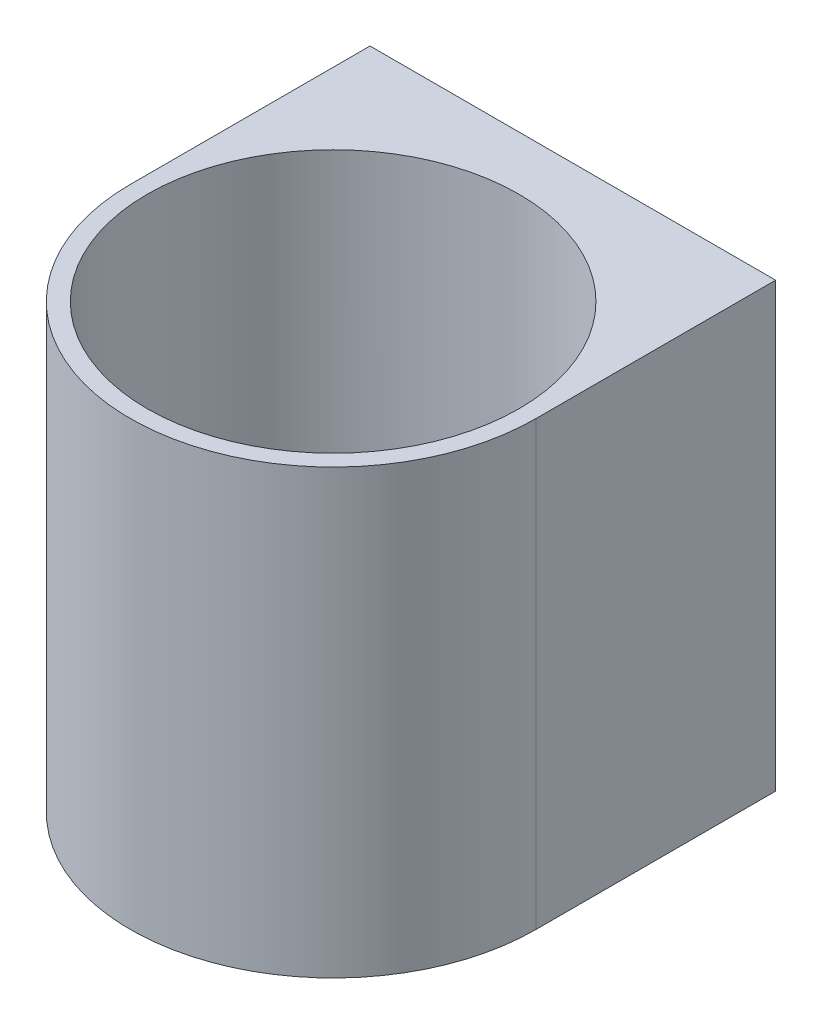
ISO-10303-21;
HEADER;
FILE_DESCRIPTION(('STEP AP214'),'2;1');
FILE_NAME('part.step','',(''),(''),'','','');
FILE_SCHEMA(('AUTOMOTIVE_DESIGN { 1 0 10303 214 1 1 1 1 }'));
ENDSEC;
DATA;
#1=APPLICATION_CONTEXT('core data for automotive mechanical design processes');
#2=APPLICATION_PROTOCOL_DEFINITION('international standard','automotive_design',2000,#1);
#3=PRODUCT_CONTEXT('',#1,'mechanical');
#4=PRODUCT('Part','Part','',(#3));
#5=PRODUCT_RELATED_PRODUCT_CATEGORY('part','',(#4));
#6=PRODUCT_DEFINITION_FORMATION('','',#4);
#7=PRODUCT_DEFINITION_CONTEXT('part definition',#1,'design');
#8=PRODUCT_DEFINITION('design','',#6,#7);
#9=PRODUCT_DEFINITION_SHAPE('','',#8);
#10=(LENGTH_UNIT() NAMED_UNIT(*) SI_UNIT(.MILLI.,.METRE.));
#11=(NAMED_UNIT(*) PLANE_ANGLE_UNIT() SI_UNIT($,.RADIAN.));
#12=(NAMED_UNIT(*) SI_UNIT($,.STERADIAN.) SOLID_ANGLE_UNIT());
#13=UNCERTAINTY_MEASURE_WITH_UNIT(LENGTH_MEASURE(1.E-05),#10,'distance_accuracy_value','');
#14=(GEOMETRIC_REPRESENTATION_CONTEXT(3) GLOBAL_UNCERTAINTY_ASSIGNED_CONTEXT((#13)) GLOBAL_UNIT_ASSIGNED_CONTEXT((#10,
#11,#12)) REPRESENTATION_CONTEXT('',''));
#15=CARTESIAN_POINT('',(0.,0.,0.));
#16=DIRECTION('',(0.,0.,1.));
#17=DIRECTION('',(1.,0.,0.));
#18=AXIS2_PLACEMENT_3D('',#15,#16,#17);
#19=CARTESIAN_POINT('',(-18.0065789473684,60.,16.0361842105263));
#20=DIRECTION('',(0.,-1.,0.));
#21=DIRECTION('',(0.,0.,-1.));
#22=AXIS2_PLACEMENT_3D('',#19,#20,#21);
#23=CYLINDRICAL_SURFACE('',#22,25.2);
#24=CARTESIAN_POINT('',(-18.0065789473684,60.,16.0361842105263));
#25=DIRECTION('',(0.,1.,0.));
#26=DIRECTION('',(0.,0.,1.));
#27=AXIS2_PLACEMENT_3D('',#24,#25,#26);
#28=CIRCLE('',#27,25.2);
#29=CARTESIAN_POINT('',(-18.0065789473684,60.,41.2361842105263));
#30=VERTEX_POINT('',#29);
#31=EDGE_CURVE('E172',#30,#30,#28,.T.);
#32=ORIENTED_EDGE('',*,*,#31,.T.);
#33=EDGE_LOOP('',(#32));
#34=FACE_BOUND('',#33,.T.);
#35=CARTESIAN_POINT('',(-18.0065789473684,9.3,16.0361842105263));
#36=DIRECTION('',(0.,-1.,0.));
#37=DIRECTION('',(0.,0.,-1.));
#38=AXIS2_PLACEMENT_3D('',#35,#36,#37);
#39=CIRCLE('',#38,25.2);
#40=CARTESIAN_POINT('',(-18.0065789473684,9.3,-9.16381578947369));
#41=VERTEX_POINT('',#40);
#42=EDGE_CURVE('E175',#41,#41,#39,.T.);
#43=ORIENTED_EDGE('',*,*,#42,.T.);
#44=EDGE_LOOP('',(#43));
#45=FACE_BOUND('',#44,.T.);
#46=ADVANCED_FACE('F86',(#34,#45),#23,.F.);
#47=CARTESIAN_POINT('',(9.49342105263159,60.,0.));
#48=DIRECTION('',(1.,0.,0.));
#49=DIRECTION('',(0.,0.,-1.));
#50=AXIS2_PLACEMENT_3D('',#47,#48,#49);
#51=PLANE('',#50);
#52=DIRECTION('',(0.,0.,1.));
#53=VECTOR('',#52,1.);
#54=CARTESIAN_POINT('',(9.49342105263159,0.,0.));
#55=LINE('',#54,#53);
#56=CARTESIAN_POINT('',(9.49342105263159,0.,-16.4638157894737));
#57=VERTEX_POINT('',#56);
#58=CARTESIAN_POINT('',(9.49342105263159,0.,16.0361842105263));
#59=VERTEX_POINT('',#58);
#60=EDGE_CURVE('E136',#57,#59,#55,.T.);
#61=ORIENTED_EDGE('',*,*,#60,.F.);
#62=DIRECTION('',(0.,-1.,0.));
#63=VECTOR('',#62,1.);
#64=CARTESIAN_POINT('',(9.49342105263159,60.,-16.4638157894737));
#65=LINE('',#64,#63);
#66=CARTESIAN_POINT('',(9.49342105263159,60.,-16.4638157894737));
#67=VERTEX_POINT('',#66);
#68=EDGE_CURVE('E97',#67,#57,#65,.T.);
#69=ORIENTED_EDGE('',*,*,#68,.F.);
#70=DIRECTION('',(0.,0.,1.));
#71=VECTOR('',#70,1.);
#72=CARTESIAN_POINT('',(9.49342105263159,60.,0.));
#73=LINE('',#72,#71);
#74=CARTESIAN_POINT('',(9.49342105263159,60.,16.0361842105263));
#75=VERTEX_POINT('',#74);
#76=EDGE_CURVE('E134',#67,#75,#73,.T.);
#77=ORIENTED_EDGE('',*,*,#76,.T.);
#78=DIRECTION('',(0.,-1.,0.));
#79=VECTOR('',#78,1.);
#80=CARTESIAN_POINT('',(9.49342105263159,60.,16.0361842105263));
#81=LINE('',#80,#79);
#82=EDGE_CURVE('E12',#75,#59,#81,.T.);
#83=ORIENTED_EDGE('',*,*,#82,.T.);
#84=EDGE_LOOP('',(#61,#69,#77,#83));
#85=FACE_BOUND('',#84,.T.);
#86=ADVANCED_FACE('F133',(#85),#51,.T.);
#87=CARTESIAN_POINT('',(0.,60.,-16.4638157894737));
#88=DIRECTION('',(0.,0.,-1.));
#89=DIRECTION('',(-1.,0.,0.));
#90=AXIS2_PLACEMENT_3D('',#87,#88,#89);
#91=PLANE('',#90);
#92=DIRECTION('',(1.,0.,0.));
#93=VECTOR('',#92,1.);
#94=CARTESIAN_POINT('',(0.,0.,-16.4638157894737));
#95=LINE('',#94,#93);
#96=CARTESIAN_POINT('',(-45.5065789473684,0.,-16.4638157894737));
#97=VERTEX_POINT('',#96);
#98=EDGE_CURVE('E163',#97,#57,#95,.T.);
#99=ORIENTED_EDGE('',*,*,#98,.F.);
#100=DIRECTION('',(0.,-1.,0.));
#101=VECTOR('',#100,1.);
#102=CARTESIAN_POINT('',(-45.5065789473684,60.,-16.4638157894737));
#103=LINE('',#102,#101);
#104=CARTESIAN_POINT('',(-45.5065789473684,60.,-16.4638157894737));
#105=VERTEX_POINT('',#104);
#106=EDGE_CURVE('E119',#105,#97,#103,.T.);
#107=ORIENTED_EDGE('',*,*,#106,.F.);
#108=DIRECTION('',(1.,0.,0.));
#109=VECTOR('',#108,1.);
#110=CARTESIAN_POINT('',(0.,60.,-16.4638157894737));
#111=LINE('',#110,#109);
#112=EDGE_CURVE('E148',#105,#67,#111,.T.);
#113=ORIENTED_EDGE('',*,*,#112,.T.);
#114=ORIENTED_EDGE('',*,*,#68,.T.);
#115=EDGE_LOOP('',(#99,#107,#113,#114));
#116=FACE_BOUND('',#115,.T.);
#117=ADVANCED_FACE('F153',(#116),#91,.T.);
#118=CARTESIAN_POINT('',(-45.5065789473684,60.,0.));
#119=DIRECTION('',(1.,0.,0.));
#120=DIRECTION('',(0.,0.,-1.));
#121=AXIS2_PLACEMENT_3D('',#118,#119,#120);
#122=PLANE('',#121);
#123=DIRECTION('',(0.,0.,1.));
#124=VECTOR('',#123,1.);
#125=CARTESIAN_POINT('',(-45.5065789473684,0.,0.));
#126=LINE('',#125,#124);
#127=CARTESIAN_POINT('',(-45.5065789473684,0.,16.0361842105263));
#128=VERTEX_POINT('',#127);
#129=EDGE_CURVE('E151',#97,#128,#126,.T.);
#130=ORIENTED_EDGE('',*,*,#129,.T.);
#131=DIRECTION('',(0.,-1.,0.));
#132=VECTOR('',#131,1.);
#133=CARTESIAN_POINT('',(-45.5065789473684,60.,16.0361842105263));
#134=LINE('',#133,#132);
#135=CARTESIAN_POINT('',(-45.5065789473684,60.,16.0361842105263));
#136=VERTEX_POINT('',#135);
#137=EDGE_CURVE('E106',#136,#128,#134,.T.);
#138=ORIENTED_EDGE('',*,*,#137,.F.);
#139=DIRECTION('',(0.,0.,1.));
#140=VECTOR('',#139,1.);
#141=CARTESIAN_POINT('',(-45.5065789473684,60.,0.));
#142=LINE('',#141,#140);
#143=EDGE_CURVE('E155',#105,#136,#142,.T.);
#144=ORIENTED_EDGE('',*,*,#143,.F.);
#145=ORIENTED_EDGE('',*,*,#106,.T.);
#146=EDGE_LOOP('',(#130,#138,#144,#145));
#147=FACE_BOUND('',#146,.T.);
#148=ADVANCED_FACE('F180',(#147),#122,.F.);
#149=CARTESIAN_POINT('',(0.,0.,0.));
#150=DIRECTION('',(0.,1.,0.));
#151=DIRECTION('',(0.,0.,1.));
#152=AXIS2_PLACEMENT_3D('',#149,#150,#151);
#153=PLANE('',#152);
#154=CARTESIAN_POINT('',(-18.0065789473684,0.,-3.96381578947368));
#155=DIRECTION('',(0.,1.,0.));
#156=DIRECTION('',(0.,0.,1.));
#157=AXIS2_PLACEMENT_3D('',#154,#155,#156);
#158=CIRCLE('',#157,3.5);
#159=CARTESIAN_POINT('',(-18.0065789473684,0.,-0.46381578947368));
#160=VERTEX_POINT('',#159);
#161=EDGE_CURVE('E204',#160,#160,#158,.T.);
#162=ORIENTED_EDGE('',*,*,#161,.T.);
#163=EDGE_LOOP('',(#162));
#164=FACE_BOUND('',#163,.T.);
#165=CARTESIAN_POINT('',(-18.0065789473684,0.,26.0361842105263));
#166=DIRECTION('',(0.,1.,0.));
#167=DIRECTION('',(0.,0.,1.));
#168=AXIS2_PLACEMENT_3D('',#165,#166,#167);
#169=CIRCLE('',#168,3.5);
#170=CARTESIAN_POINT('',(-18.0065789473684,0.,29.5361842105263));
#171=VERTEX_POINT('',#170);
#172=EDGE_CURVE('E284',#171,#171,#169,.T.);
#173=ORIENTED_EDGE('',*,*,#172,.T.);
#174=EDGE_LOOP('',(#173));
#175=FACE_BOUND('',#174,.T.);
#176=CARTESIAN_POINT('',(-8.00657894736841,0.,26.0361842105263));
#177=DIRECTION('',(0.,1.,0.));
#178=DIRECTION('',(0.,0.,1.));
#179=AXIS2_PLACEMENT_3D('',#176,#177,#178);
#180=CIRCLE('',#179,3.5);
#181=CARTESIAN_POINT('',(-8.00657894736841,0.,29.5361842105263));
#182=VERTEX_POINT('',#181);
#183=EDGE_CURVE('E275',#182,#182,#180,.T.);
#184=ORIENTED_EDGE('',*,*,#183,.T.);
#185=EDGE_LOOP('',(#184));
#186=FACE_BOUND('',#185,.T.);
#187=CARTESIAN_POINT('',(-18.0065789473684,0.,36.0361842105263));
#188=DIRECTION('',(0.,1.,0.));
#189=DIRECTION('',(0.,0.,1.));
#190=AXIS2_PLACEMENT_3D('',#187,#188,#189);
#191=CIRCLE('',#190,3.5);
#192=CARTESIAN_POINT('',(-18.0065789473684,0.,39.5361842105263));
#193=VERTEX_POINT('',#192);
#194=EDGE_CURVE('E299',#193,#193,#191,.T.);
#195=ORIENTED_EDGE('',*,*,#194,.T.);
#196=EDGE_LOOP('',(#195));
#197=FACE_BOUND('',#196,.T.);
#198=CARTESIAN_POINT('',(-28.0065789473684,0.,16.0361842105263));
#199=DIRECTION('',(0.,1.,0.));
#200=DIRECTION('',(0.,0.,1.));
#201=AXIS2_PLACEMENT_3D('',#198,#199,#200);
#202=CIRCLE('',#201,3.5);
#203=CARTESIAN_POINT('',(-28.0065789473684,0.,19.5361842105263));
#204=VERTEX_POINT('',#203);
#205=EDGE_CURVE('E291',#204,#204,#202,.T.);
#206=ORIENTED_EDGE('',*,*,#205,.T.);
#207=EDGE_LOOP('',(#206));
#208=FACE_BOUND('',#207,.T.);
#209=CARTESIAN_POINT('',(-18.0065789473684,0.,6.03618421052632));
#210=DIRECTION('',(0.,1.,0.));
#211=DIRECTION('',(0.,0.,1.));
#212=AXIS2_PLACEMENT_3D('',#209,#210,#211);
#213=CIRCLE('',#212,3.5);
#214=CARTESIAN_POINT('',(-18.0065789473684,0.,9.53618421052632));
#215=VERTEX_POINT('',#214);
#216=EDGE_CURVE('E235',#215,#215,#213,.T.);
#217=ORIENTED_EDGE('',*,*,#216,.T.);
#218=EDGE_LOOP('',(#217));
#219=FACE_BOUND('',#218,.T.);
#220=CARTESIAN_POINT('',(-28.0065789473684,0.,6.03618421052632));
#221=DIRECTION('',(0.,1.,0.));
#222=DIRECTION('',(0.,0.,1.));
#223=AXIS2_PLACEMENT_3D('',#220,#221,#222);
#224=CIRCLE('',#223,3.5);
#225=CARTESIAN_POINT('',(-28.0065789473684,0.,9.53618421052632));
#226=VERTEX_POINT('',#225);
#227=EDGE_CURVE('E227',#226,#226,#224,.T.);
#228=ORIENTED_EDGE('',*,*,#227,.T.);
#229=EDGE_LOOP('',(#228));
#230=FACE_BOUND('',#229,.T.);
#231=CARTESIAN_POINT('',(-8.00657894736841,0.,6.03618421052632));
#232=DIRECTION('',(0.,1.,0.));
#233=DIRECTION('',(0.,0.,1.));
#234=AXIS2_PLACEMENT_3D('',#231,#232,#233);
#235=CIRCLE('',#234,3.5);
#236=CARTESIAN_POINT('',(-8.00657894736841,0.,9.53618421052632));
#237=VERTEX_POINT('',#236);
#238=EDGE_CURVE('E219',#237,#237,#235,.T.);
#239=ORIENTED_EDGE('',*,*,#238,.T.);
#240=EDGE_LOOP('',(#239));
#241=FACE_BOUND('',#240,.T.);
#242=CARTESIAN_POINT('',(-8.00657894736841,0.,16.0361842105263));
#243=DIRECTION('',(0.,1.,0.));
#244=DIRECTION('',(0.,0.,1.));
#245=AXIS2_PLACEMENT_3D('',#242,#243,#244);
#246=CIRCLE('',#245,3.5);
#247=CARTESIAN_POINT('',(-8.00657894736841,0.,19.5361842105263));
#248=VERTEX_POINT('',#247);
#249=EDGE_CURVE('E210',#248,#248,#246,.T.);
#250=ORIENTED_EDGE('',*,*,#249,.T.);
#251=EDGE_LOOP('',(#250));
#252=FACE_BOUND('',#251,.T.);
#253=CARTESIAN_POINT('',(1.99342105263159,0.,16.0361842105263));
#254=DIRECTION('',(0.,1.,0.));
#255=DIRECTION('',(0.,0.,1.));
#256=AXIS2_PLACEMENT_3D('',#253,#254,#255);
#257=CIRCLE('',#256,3.5);
#258=CARTESIAN_POINT('',(1.99342105263159,0.,19.5361842105263));
#259=VERTEX_POINT('',#258);
#260=EDGE_CURVE('E268',#259,#259,#257,.T.);
#261=ORIENTED_EDGE('',*,*,#260,.T.);
#262=EDGE_LOOP('',(#261));
#263=FACE_BOUND('',#262,.T.);
#264=CARTESIAN_POINT('',(-18.0065789473684,0.,16.0361842105263));
#265=DIRECTION('',(0.,1.,0.));
#266=DIRECTION('',(0.,0.,1.));
#267=AXIS2_PLACEMENT_3D('',#264,#265,#266);
#268=CIRCLE('',#267,3.5);
#269=CARTESIAN_POINT('',(-18.0065789473684,0.,19.5361842105263));
#270=VERTEX_POINT('',#269);
#271=EDGE_CURVE('E260',#270,#270,#268,.T.);
#272=ORIENTED_EDGE('',*,*,#271,.T.);
#273=EDGE_LOOP('',(#272));
#274=FACE_BOUND('',#273,.T.);
#275=CARTESIAN_POINT('',(-38.0065789473684,0.,16.0361842105263));
#276=DIRECTION('',(0.,1.,0.));
#277=DIRECTION('',(0.,0.,1.));
#278=AXIS2_PLACEMENT_3D('',#275,#276,#277);
#279=CIRCLE('',#278,3.5);
#280=CARTESIAN_POINT('',(-38.0065789473684,0.,19.5361842105263));
#281=VERTEX_POINT('',#280);
#282=EDGE_CURVE('E252',#281,#281,#279,.T.);
#283=ORIENTED_EDGE('',*,*,#282,.T.);
#284=EDGE_LOOP('',(#283));
#285=FACE_BOUND('',#284,.T.);
#286=CARTESIAN_POINT('',(-28.0065789473684,0.,26.0361842105263));
#287=DIRECTION('',(0.,1.,0.));
#288=DIRECTION('',(0.,0.,1.));
#289=AXIS2_PLACEMENT_3D('',#286,#287,#288);
#290=CIRCLE('',#289,3.5);
#291=CARTESIAN_POINT('',(-28.0065789473684,0.,29.5361842105263));
#292=VERTEX_POINT('',#291);
#293=EDGE_CURVE('E243',#292,#292,#290,.T.);
#294=ORIENTED_EDGE('',*,*,#293,.T.);
#295=EDGE_LOOP('',(#294));
#296=FACE_BOUND('',#295,.T.);
#297=ORIENTED_EDGE('',*,*,#60,.T.);
#298=CARTESIAN_POINT('',(-18.0065789473684,0.,16.0361842105263));
#299=DIRECTION('',(0.,1.,0.));
#300=DIRECTION('',(0.,0.,1.));
#301=AXIS2_PLACEMENT_3D('',#298,#299,#300);
#302=CIRCLE('',#301,27.5);
#303=EDGE_CURVE('E90',#128,#59,#302,.T.);
#304=ORIENTED_EDGE('',*,*,#303,.F.);
#305=ORIENTED_EDGE('',*,*,#129,.F.);
#306=ORIENTED_EDGE('',*,*,#98,.T.);
#307=EDGE_LOOP('',(#297,#304,#305,#306));
#308=FACE_BOUND('',#307,.T.);
#309=ADVANCED_FACE('F179',(#164,#175,#186,#197,#208,#219,#230,#241,#252,#263,#274,#285,#296,
#308),#153,.F.);
#310=CARTESIAN_POINT('',(0.,60.,0.));
#311=DIRECTION('',(0.,1.,0.));
#312=DIRECTION('',(0.,0.,1.));
#313=AXIS2_PLACEMENT_3D('',#310,#311,#312);
#314=PLANE('',#313);
#315=ORIENTED_EDGE('',*,*,#143,.T.);
#316=CARTESIAN_POINT('',(-18.0065789473684,60.,16.0361842105263));
#317=DIRECTION('',(0.,1.,0.));
#318=DIRECTION('',(0.,0.,1.));
#319=AXIS2_PLACEMENT_3D('',#316,#317,#318);
#320=CIRCLE('',#319,27.5);
#321=EDGE_CURVE('E149',#136,#75,#320,.T.);
#322=ORIENTED_EDGE('',*,*,#321,.T.);
#323=ORIENTED_EDGE('',*,*,#76,.F.);
#324=ORIENTED_EDGE('',*,*,#112,.F.);
#325=EDGE_LOOP('',(#315,#322,#323,#324));
#326=FACE_BOUND('',#325,.T.);
#327=ORIENTED_EDGE('',*,*,#31,.F.);
#328=EDGE_LOOP('',(#327));
#329=FACE_BOUND('',#328,.T.);
#330=ADVANCED_FACE('F146',(#326,#329),#314,.T.);
#331=CARTESIAN_POINT('',(-18.0065789473684,60.,16.0361842105263));
#332=DIRECTION('',(0.,-1.,0.));
#333=DIRECTION('',(0.,0.,-1.));
#334=AXIS2_PLACEMENT_3D('',#331,#332,#333);
#335=CYLINDRICAL_SURFACE('',#334,27.5);
#336=ORIENTED_EDGE('',*,*,#303,.T.);
#337=ORIENTED_EDGE('',*,*,#82,.F.);
#338=ORIENTED_EDGE('',*,*,#321,.F.);
#339=ORIENTED_EDGE('',*,*,#137,.T.);
#340=EDGE_LOOP('',(#336,#337,#338,#339));
#341=FACE_BOUND('',#340,.T.);
#342=ADVANCED_FACE('F88',(#341),#335,.T.);
#343=CARTESIAN_POINT('',(-18.0065789473684,9.3,16.0361842105263));
#344=DIRECTION('',(0.,-1.,0.));
#345=DIRECTION('',(0.,0.,-1.));
#346=AXIS2_PLACEMENT_3D('',#343,#344,#345);
#347=PLANE('',#346);
#348=CARTESIAN_POINT('',(-18.0065789473684,9.3,-3.96381578947368));
#349=DIRECTION('',(0.,1.,0.));
#350=DIRECTION('',(0.,0.,1.));
#351=AXIS2_PLACEMENT_3D('',#348,#349,#350);
#352=CIRCLE('',#351,3.5);
#353=CARTESIAN_POINT('',(-18.0065789473684,9.3,-0.46381578947368));
#354=VERTEX_POINT('',#353);
#355=EDGE_CURVE('E207',#354,#354,#352,.T.);
#356=ORIENTED_EDGE('',*,*,#355,.F.);
#357=EDGE_LOOP('',(#356));
#358=FACE_BOUND('',#357,.T.);
#359=CARTESIAN_POINT('',(-18.0065789473684,9.3,26.0361842105263));
#360=DIRECTION('',(0.,1.,0.));
#361=DIRECTION('',(0.,0.,1.));
#362=AXIS2_PLACEMENT_3D('',#359,#360,#361);
#363=CIRCLE('',#362,3.5);
#364=CARTESIAN_POINT('',(-18.0065789473684,9.3,29.5361842105263));
#365=VERTEX_POINT('',#364);
#366=EDGE_CURVE('E248',#365,#365,#363,.T.);
#367=ORIENTED_EDGE('',*,*,#366,.F.);
#368=EDGE_LOOP('',(#367));
#369=FACE_BOUND('',#368,.T.);
#370=CARTESIAN_POINT('',(-8.00657894736841,9.3,26.0361842105263));
#371=DIRECTION('',(0.,1.,0.));
#372=DIRECTION('',(0.,0.,1.));
#373=AXIS2_PLACEMENT_3D('',#370,#371,#372);
#374=CIRCLE('',#373,3.5);
#375=CARTESIAN_POINT('',(-8.00657894736841,9.3,29.5361842105263));
#376=VERTEX_POINT('',#375);
#377=EDGE_CURVE('E279',#376,#376,#374,.T.);
#378=ORIENTED_EDGE('',*,*,#377,.F.);
#379=EDGE_LOOP('',(#378));
#380=FACE_BOUND('',#379,.T.);
#381=CARTESIAN_POINT('',(-18.0065789473684,9.3,36.0361842105263));
#382=DIRECTION('',(0.,1.,0.));
#383=DIRECTION('',(0.,0.,1.));
#384=AXIS2_PLACEMENT_3D('',#381,#382,#383);
#385=CIRCLE('',#384,3.5);
#386=CARTESIAN_POINT('',(-18.0065789473684,9.3,39.5361842105263));
#387=VERTEX_POINT('',#386);
#388=EDGE_CURVE('E280',#387,#387,#385,.T.);
#389=ORIENTED_EDGE('',*,*,#388,.F.);
#390=EDGE_LOOP('',(#389));
#391=FACE_BOUND('',#390,.T.);
#392=CARTESIAN_POINT('',(-28.0065789473684,9.3,16.0361842105263));
#393=DIRECTION('',(0.,1.,0.));
#394=DIRECTION('',(0.,0.,1.));
#395=AXIS2_PLACEMENT_3D('',#392,#393,#394);
#396=CIRCLE('',#395,3.5);
#397=CARTESIAN_POINT('',(-28.0065789473684,9.3,19.5361842105263));
#398=VERTEX_POINT('',#397);
#399=EDGE_CURVE('E295',#398,#398,#396,.T.);
#400=ORIENTED_EDGE('',*,*,#399,.F.);
#401=EDGE_LOOP('',(#400));
#402=FACE_BOUND('',#401,.T.);
#403=CARTESIAN_POINT('',(-18.0065789473684,9.3,6.03618421052632));
#404=DIRECTION('',(0.,1.,0.));
#405=DIRECTION('',(0.,0.,1.));
#406=AXIS2_PLACEMENT_3D('',#403,#404,#405);
#407=CIRCLE('',#406,3.5);
#408=CARTESIAN_POINT('',(-18.0065789473684,9.3,9.53618421052632));
#409=VERTEX_POINT('',#408);
#410=EDGE_CURVE('E239',#409,#409,#407,.T.);
#411=ORIENTED_EDGE('',*,*,#410,.F.);
#412=EDGE_LOOP('',(#411));
#413=FACE_BOUND('',#412,.T.);
#414=CARTESIAN_POINT('',(-28.0065789473684,9.3,6.03618421052632));
#415=DIRECTION('',(0.,1.,0.));
#416=DIRECTION('',(0.,0.,1.));
#417=AXIS2_PLACEMENT_3D('',#414,#415,#416);
#418=CIRCLE('',#417,3.5);
#419=CARTESIAN_POINT('',(-28.0065789473684,9.3,9.53618421052632));
#420=VERTEX_POINT('',#419);
#421=EDGE_CURVE('E231',#420,#420,#418,.T.);
#422=ORIENTED_EDGE('',*,*,#421,.F.);
#423=EDGE_LOOP('',(#422));
#424=FACE_BOUND('',#423,.T.);
#425=CARTESIAN_POINT('',(-8.00657894736841,9.3,6.03618421052632));
#426=DIRECTION('',(0.,1.,0.));
#427=DIRECTION('',(0.,0.,1.));
#428=AXIS2_PLACEMENT_3D('',#425,#426,#427);
#429=CIRCLE('',#428,3.5);
#430=CARTESIAN_POINT('',(-8.00657894736841,9.3,9.53618421052632));
#431=VERTEX_POINT('',#430);
#432=EDGE_CURVE('E223',#431,#431,#429,.T.);
#433=ORIENTED_EDGE('',*,*,#432,.F.);
#434=EDGE_LOOP('',(#433));
#435=FACE_BOUND('',#434,.T.);
#436=CARTESIAN_POINT('',(-8.00657894736841,9.3,16.0361842105263));
#437=DIRECTION('',(0.,1.,0.));
#438=DIRECTION('',(0.,0.,1.));
#439=AXIS2_PLACEMENT_3D('',#436,#437,#438);
#440=CIRCLE('',#439,3.5);
#441=CARTESIAN_POINT('',(-8.00657894736841,9.3,19.5361842105263));
#442=VERTEX_POINT('',#441);
#443=EDGE_CURVE('E214',#442,#442,#440,.T.);
#444=ORIENTED_EDGE('',*,*,#443,.F.);
#445=EDGE_LOOP('',(#444));
#446=FACE_BOUND('',#445,.T.);
#447=CARTESIAN_POINT('',(1.99342105263159,9.3,16.0361842105263));
#448=DIRECTION('',(0.,1.,0.));
#449=DIRECTION('',(0.,0.,1.));
#450=AXIS2_PLACEMENT_3D('',#447,#448,#449);
#451=CIRCLE('',#450,3.5);
#452=CARTESIAN_POINT('',(1.99342105263159,9.3,19.5361842105263));
#453=VERTEX_POINT('',#452);
#454=EDGE_CURVE('E215',#453,#453,#451,.T.);
#455=ORIENTED_EDGE('',*,*,#454,.F.);
#456=EDGE_LOOP('',(#455));
#457=FACE_BOUND('',#456,.T.);
#458=CARTESIAN_POINT('',(-18.0065789473684,9.3,16.0361842105263));
#459=DIRECTION('',(0.,1.,0.));
#460=DIRECTION('',(0.,0.,1.));
#461=AXIS2_PLACEMENT_3D('',#458,#459,#460);
#462=CIRCLE('',#461,3.5);
#463=CARTESIAN_POINT('',(-18.0065789473684,9.3,19.5361842105263));
#464=VERTEX_POINT('',#463);
#465=EDGE_CURVE('E264',#464,#464,#462,.T.);
#466=ORIENTED_EDGE('',*,*,#465,.F.);
#467=EDGE_LOOP('',(#466));
#468=FACE_BOUND('',#467,.T.);
#469=CARTESIAN_POINT('',(-38.0065789473684,9.3,16.0361842105263));
#470=DIRECTION('',(0.,1.,0.));
#471=DIRECTION('',(0.,0.,1.));
#472=AXIS2_PLACEMENT_3D('',#469,#470,#471);
#473=CIRCLE('',#472,3.5);
#474=CARTESIAN_POINT('',(-38.0065789473684,9.3,19.5361842105263));
#475=VERTEX_POINT('',#474);
#476=EDGE_CURVE('E256',#475,#475,#473,.T.);
#477=ORIENTED_EDGE('',*,*,#476,.F.);
#478=EDGE_LOOP('',(#477));
#479=FACE_BOUND('',#478,.T.);
#480=CARTESIAN_POINT('',(-28.0065789473684,9.3,26.0361842105263));
#481=DIRECTION('',(0.,1.,0.));
#482=DIRECTION('',(0.,0.,1.));
#483=AXIS2_PLACEMENT_3D('',#480,#481,#482);
#484=CIRCLE('',#483,3.5);
#485=CARTESIAN_POINT('',(-28.0065789473684,9.3,29.5361842105263));
#486=VERTEX_POINT('',#485);
#487=EDGE_CURVE('E247',#486,#486,#484,.T.);
#488=ORIENTED_EDGE('',*,*,#487,.F.);
#489=EDGE_LOOP('',(#488));
#490=FACE_BOUND('',#489,.T.);
#491=ORIENTED_EDGE('',*,*,#42,.F.);
#492=EDGE_LOOP('',(#491));
#493=FACE_BOUND('',#492,.T.);
#494=ADVANCED_FACE('F312',(#358,#369,#380,#391,#402,#413,#424,#435,#446,#457,#468,#479,#490,
#493),#347,.F.);
#495=CARTESIAN_POINT('',(-28.0065789473684,0.,26.0361842105263));
#496=DIRECTION('',(0.,1.,0.));
#497=DIRECTION('',(0.,0.,1.));
#498=AXIS2_PLACEMENT_3D('',#495,#496,#497);
#499=CYLINDRICAL_SURFACE('',#498,3.5);
#500=ORIENTED_EDGE('',*,*,#293,.F.);
#501=EDGE_LOOP('',(#500));
#502=FACE_BOUND('',#501,.T.);
#503=ORIENTED_EDGE('',*,*,#487,.T.);
#504=EDGE_LOOP('',(#503));
#505=FACE_BOUND('',#504,.T.);
#506=ADVANCED_FACE('F315',(#502,#505),#499,.F.);
#507=CARTESIAN_POINT('',(-38.0065789473684,0.,16.0361842105263));
#508=DIRECTION('',(0.,1.,0.));
#509=DIRECTION('',(0.,0.,1.));
#510=AXIS2_PLACEMENT_3D('',#507,#508,#509);
#511=CYLINDRICAL_SURFACE('',#510,3.5);
#512=ORIENTED_EDGE('',*,*,#282,.F.);
#513=EDGE_LOOP('',(#512));
#514=FACE_BOUND('',#513,.T.);
#515=ORIENTED_EDGE('',*,*,#476,.T.);
#516=EDGE_LOOP('',(#515));
#517=FACE_BOUND('',#516,.T.);
#518=ADVANCED_FACE('F342',(#514,#517),#511,.F.);
#519=CARTESIAN_POINT('',(-18.0065789473684,0.,16.0361842105263));
#520=DIRECTION('',(0.,1.,0.));
#521=DIRECTION('',(0.,0.,1.));
#522=AXIS2_PLACEMENT_3D('',#519,#520,#521);
#523=CYLINDRICAL_SURFACE('',#522,3.5);
#524=ORIENTED_EDGE('',*,*,#271,.F.);
#525=EDGE_LOOP('',(#524));
#526=FACE_BOUND('',#525,.T.);
#527=ORIENTED_EDGE('',*,*,#465,.T.);
#528=EDGE_LOOP('',(#527));
#529=FACE_BOUND('',#528,.T.);
#530=ADVANCED_FACE('F348',(#526,#529),#523,.F.);
#531=CARTESIAN_POINT('',(1.99342105263159,0.,16.0361842105263));
#532=DIRECTION('',(0.,1.,0.));
#533=DIRECTION('',(0.,0.,1.));
#534=AXIS2_PLACEMENT_3D('',#531,#532,#533);
#535=CYLINDRICAL_SURFACE('',#534,3.5);
#536=ORIENTED_EDGE('',*,*,#260,.F.);
#537=EDGE_LOOP('',(#536));
#538=FACE_BOUND('',#537,.T.);
#539=ORIENTED_EDGE('',*,*,#454,.T.);
#540=EDGE_LOOP('',(#539));
#541=FACE_BOUND('',#540,.T.);
#542=ADVANCED_FACE('F369',(#538,#541),#535,.F.);
#543=CARTESIAN_POINT('',(-8.00657894736841,0.,16.0361842105263));
#544=DIRECTION('',(0.,1.,0.));
#545=DIRECTION('',(0.,0.,1.));
#546=AXIS2_PLACEMENT_3D('',#543,#544,#545);
#547=CYLINDRICAL_SURFACE('',#546,3.5);
#548=ORIENTED_EDGE('',*,*,#249,.F.);
#549=EDGE_LOOP('',(#548));
#550=FACE_BOUND('',#549,.T.);
#551=ORIENTED_EDGE('',*,*,#443,.T.);
#552=EDGE_LOOP('',(#551));
#553=FACE_BOUND('',#552,.T.);
#554=ADVANCED_FACE('F366',(#550,#553),#547,.F.);
#555=CARTESIAN_POINT('',(-8.00657894736841,0.,6.03618421052632));
#556=DIRECTION('',(0.,1.,0.));
#557=DIRECTION('',(0.,0.,1.));
#558=AXIS2_PLACEMENT_3D('',#555,#556,#557);
#559=CYLINDRICAL_SURFACE('',#558,3.5);
#560=ORIENTED_EDGE('',*,*,#238,.F.);
#561=EDGE_LOOP('',(#560));
#562=FACE_BOUND('',#561,.T.);
#563=ORIENTED_EDGE('',*,*,#432,.T.);
#564=EDGE_LOOP('',(#563));
#565=FACE_BOUND('',#564,.T.);
#566=ADVANCED_FACE('F362',(#562,#565),#559,.F.);
#567=CARTESIAN_POINT('',(-28.0065789473684,0.,6.03618421052632));
#568=DIRECTION('',(0.,1.,0.));
#569=DIRECTION('',(0.,0.,1.));
#570=AXIS2_PLACEMENT_3D('',#567,#568,#569);
#571=CYLINDRICAL_SURFACE('',#570,3.5);
#572=ORIENTED_EDGE('',*,*,#227,.F.);
#573=EDGE_LOOP('',(#572));
#574=FACE_BOUND('',#573,.T.);
#575=ORIENTED_EDGE('',*,*,#421,.T.);
#576=EDGE_LOOP('',(#575));
#577=FACE_BOUND('',#576,.T.);
#578=ADVANCED_FACE('F358',(#574,#577),#571,.F.);
#579=CARTESIAN_POINT('',(-18.0065789473684,0.,6.03618421052632));
#580=DIRECTION('',(0.,1.,0.));
#581=DIRECTION('',(0.,0.,1.));
#582=AXIS2_PLACEMENT_3D('',#579,#580,#581);
#583=CYLINDRICAL_SURFACE('',#582,3.5);
#584=ORIENTED_EDGE('',*,*,#216,.F.);
#585=EDGE_LOOP('',(#584));
#586=FACE_BOUND('',#585,.T.);
#587=ORIENTED_EDGE('',*,*,#410,.T.);
#588=EDGE_LOOP('',(#587));
#589=FACE_BOUND('',#588,.T.);
#590=ADVANCED_FACE('F354',(#586,#589),#583,.F.);
#591=CARTESIAN_POINT('',(-28.0065789473684,0.,16.0361842105263));
#592=DIRECTION('',(0.,1.,0.));
#593=DIRECTION('',(0.,0.,1.));
#594=AXIS2_PLACEMENT_3D('',#591,#592,#593);
#595=CYLINDRICAL_SURFACE('',#594,3.5);
#596=ORIENTED_EDGE('',*,*,#205,.F.);
#597=EDGE_LOOP('',(#596));
#598=FACE_BOUND('',#597,.T.);
#599=ORIENTED_EDGE('',*,*,#399,.T.);
#600=EDGE_LOOP('',(#599));
#601=FACE_BOUND('',#600,.T.);
#602=ADVANCED_FACE('F357',(#598,#601),#595,.F.);
#603=CARTESIAN_POINT('',(-18.0065789473684,0.,36.0361842105263));
#604=DIRECTION('',(0.,1.,0.));
#605=DIRECTION('',(0.,0.,1.));
#606=AXIS2_PLACEMENT_3D('',#603,#604,#605);
#607=CYLINDRICAL_SURFACE('',#606,3.5);
#608=ORIENTED_EDGE('',*,*,#194,.F.);
#609=EDGE_LOOP('',(#608));
#610=FACE_BOUND('',#609,.T.);
#611=ORIENTED_EDGE('',*,*,#388,.T.);
#612=EDGE_LOOP('',(#611));
#613=FACE_BOUND('',#612,.T.);
#614=ADVANCED_FACE('F458',(#610,#613),#607,.F.);
#615=CARTESIAN_POINT('',(-8.00657894736841,0.,26.0361842105263));
#616=DIRECTION('',(0.,1.,0.));
#617=DIRECTION('',(0.,0.,1.));
#618=AXIS2_PLACEMENT_3D('',#615,#616,#617);
#619=CYLINDRICAL_SURFACE('',#618,3.5);
#620=ORIENTED_EDGE('',*,*,#183,.F.);
#621=EDGE_LOOP('',(#620));
#622=FACE_BOUND('',#621,.T.);
#623=ORIENTED_EDGE('',*,*,#377,.T.);
#624=EDGE_LOOP('',(#623));
#625=FACE_BOUND('',#624,.T.);
#626=ADVANCED_FACE('F471',(#622,#625),#619,.F.);
#627=CARTESIAN_POINT('',(-18.0065789473684,0.,26.0361842105263));
#628=DIRECTION('',(0.,1.,0.));
#629=DIRECTION('',(0.,0.,1.));
#630=AXIS2_PLACEMENT_3D('',#627,#628,#629);
#631=CYLINDRICAL_SURFACE('',#630,3.5);
#632=ORIENTED_EDGE('',*,*,#172,.F.);
#633=EDGE_LOOP('',(#632));
#634=FACE_BOUND('',#633,.T.);
#635=ORIENTED_EDGE('',*,*,#366,.T.);
#636=EDGE_LOOP('',(#635));
#637=FACE_BOUND('',#636,.T.);
#638=ADVANCED_FACE('F481',(#634,#637),#631,.F.);
#639=CARTESIAN_POINT('',(-18.0065789473684,0.,-3.96381578947368));
#640=DIRECTION('',(0.,1.,0.));
#641=DIRECTION('',(0.,0.,1.));
#642=AXIS2_PLACEMENT_3D('',#639,#640,#641);
#643=CYLINDRICAL_SURFACE('',#642,3.5);
#644=ORIENTED_EDGE('',*,*,#161,.F.);
#645=EDGE_LOOP('',(#644));
#646=FACE_BOUND('',#645,.T.);
#647=ORIENTED_EDGE('',*,*,#355,.T.);
#648=EDGE_LOOP('',(#647));
#649=FACE_BOUND('',#648,.T.);
#650=ADVANCED_FACE('F310',(#646,#649),#643,.F.);
#651=CLOSED_SHELL('',(#46,#86,#117,#148,#309,#330,#342,#494,#506,#518,#530,#542,#554,#566,#578,
#590,#602,#614,#626,#638,#650));
#652=MANIFOLD_SOLID_BREP('B2',#651);
#653=ADVANCED_BREP_SHAPE_REPRESENTATION('',(#18,#652),#14);
#654=SHAPE_DEFINITION_REPRESENTATION(#9,#653);
ENDSEC;
END-ISO-10303-21;
